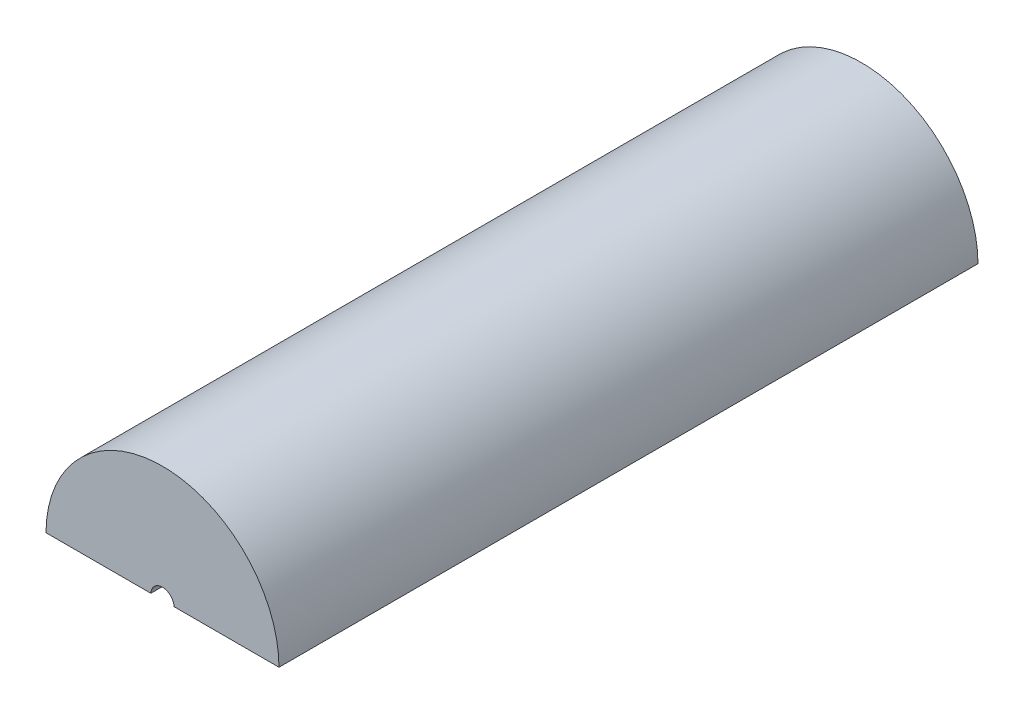
ISO-10303-21;
HEADER;
FILE_DESCRIPTION(('STEP AP214'),'2;1');
FILE_NAME('part.step','',(''),(''),'','','');
FILE_SCHEMA(('AUTOMOTIVE_DESIGN { 1 0 10303 214 1 1 1 1 }'));
ENDSEC;
DATA;
#1=APPLICATION_CONTEXT('core data for automotive mechanical design processes');
#2=APPLICATION_PROTOCOL_DEFINITION('international standard','automotive_design',2000,#1);
#3=PRODUCT_CONTEXT('',#1,'mechanical');
#4=PRODUCT('Part','Part','',(#3));
#5=PRODUCT_RELATED_PRODUCT_CATEGORY('part','',(#4));
#6=PRODUCT_DEFINITION_FORMATION('','',#4);
#7=PRODUCT_DEFINITION_CONTEXT('part definition',#1,'design');
#8=PRODUCT_DEFINITION('design','',#6,#7);
#9=PRODUCT_DEFINITION_SHAPE('','',#8);
#10=(LENGTH_UNIT() NAMED_UNIT(*) SI_UNIT(.MILLI.,.METRE.));
#11=(NAMED_UNIT(*) PLANE_ANGLE_UNIT() SI_UNIT($,.RADIAN.));
#12=(NAMED_UNIT(*) SI_UNIT($,.STERADIAN.) SOLID_ANGLE_UNIT());
#13=UNCERTAINTY_MEASURE_WITH_UNIT(LENGTH_MEASURE(1.E-05),#10,'distance_accuracy_value','');
#14=(GEOMETRIC_REPRESENTATION_CONTEXT(3) GLOBAL_UNCERTAINTY_ASSIGNED_CONTEXT((#13)) GLOBAL_UNIT_ASSIGNED_CONTEXT((#10,
#11,#12)) REPRESENTATION_CONTEXT('',''));
#15=CARTESIAN_POINT('',(0.,0.,0.));
#16=DIRECTION('',(0.,0.,1.));
#17=DIRECTION('',(1.,0.,0.));
#18=AXIS2_PLACEMENT_3D('',#15,#16,#17);
#19=CARTESIAN_POINT('',(0.,0.,-95.));
#20=DIRECTION('',(0.,0.,1.));
#21=DIRECTION('',(1.,0.,0.));
#22=AXIS2_PLACEMENT_3D('',#19,#20,#21);
#23=CYLINDRICAL_SURFACE('',#22,16.);
#24=CARTESIAN_POINT('',(15.9996874956982,0.100000200000962,-95.0002));
#25=CARTESIAN_POINT('',(15.9996876089245,0.0999613166636497,-94.9933909110656));
#26=CARTESIAN_POINT('',(15.9996833359999,0.100667343260459,-94.9866189886162));
#27=CARTESIAN_POINT('',(15.9996664742526,0.103322093203284,-94.9734331409172));
#28=CARTESIAN_POINT('',(15.9996540231289,0.105250221129936,-94.9670151631769));
#29=CARTESIAN_POINT('',(15.9996167256408,0.110786102343066,-94.9528734828148));
#30=CARTESIAN_POINT('',(15.9995894090706,0.11471028723087,-94.9452773244607));
#31=CARTESIAN_POINT('',(15.9995223957738,0.12370890358297,-94.9307562380063));
#32=CARTESIAN_POINT('',(15.999482612251,0.128791329006479,-94.9238364763829));
#33=CARTESIAN_POINT('',(15.9993504725112,0.144525673591268,-94.904808843254));
#34=CARTESIAN_POINT('',(15.9992426946636,0.1561363522168,-94.8935076802659));
#35=CARTESIAN_POINT('',(15.998984408498,0.180705288968248,-94.8725336488729));
#36=CARTESIAN_POINT('',(15.9988338081395,0.193666411233282,-94.8628643600561));
#37=CARTESIAN_POINT('',(15.9980346259693,0.255298625632148,-94.8205617079184));
#38=CARTESIAN_POINT('',(15.9971179787717,0.308242970572141,-94.7944084734029));
#39=CARTESIAN_POINT('',(15.9946762218346,0.416398657564381,-94.747491478125));
#40=CARTESIAN_POINT('',(15.9931468802502,0.471623319166156,-94.7267668945409));
#41=CARTESIAN_POINT('',(15.9876683633117,0.637564752046911,-94.6698337453855));
#42=CARTESIAN_POINT('',(15.982813728992,0.749883874807342,-94.6382317593188));
#43=CARTESIAN_POINT('',(15.9706204430243,0.975817455917367,-94.5805638647358));
#44=CARTESIAN_POINT('',(15.9632772031576,1.08943392957803,-94.5545083276732));
#45=CARTESIAN_POINT('',(15.946108566696,1.31703651192761,-94.5060300565223));
#46=CARTESIAN_POINT('',(15.9362882944059,1.43102138372045,-94.4835999776359));
#47=CARTESIAN_POINT('',(15.9141618109084,1.65909642172321,-94.441203693864));
#48=CARTESIAN_POINT('',(15.9018574595061,1.77318644596788,-94.421235663577));
#49=CARTESIAN_POINT('',(15.8386705583791,2.30505946467228,-94.3321411780839));
#50=CARTESIAN_POINT('',(15.7722764358871,2.72289413244487,-94.2736362565787));
#51=CARTESIAN_POINT('',(15.6061590460522,3.55355292641803,-94.1673325131355));
#52=CARTESIAN_POINT('',(15.5063990006465,3.9663710003421,-94.1195456028093));
#53=CARTESIAN_POINT('',(15.2738971238386,4.78425016336286,-94.0310629905377));
#54=CARTESIAN_POINT('',(15.1410951067343,5.18929562832988,-93.9903804618779));
#55=CARTESIAN_POINT('',(14.8434558371158,5.98776591234989,-93.9141900760265));
#56=CARTESIAN_POINT('',(14.6786295456577,6.3811946545708,-93.8786804555422));
#57=CARTESIAN_POINT('',(14.3183042194909,7.15312590557042,-93.8118329726691));
#58=CARTESIAN_POINT('',(14.122868793987,7.53165737562533,-93.7804867026022));
#59=CARTESIAN_POINT('',(13.7022902081215,8.27215629418123,-93.721208755686));
#60=CARTESIAN_POINT('',(13.4771448061774,8.63412249007385,-93.6932773367896));
#61=CARTESIAN_POINT('',(12.9987065689512,9.3388932284815,-93.6404131747481));
#62=CARTESIAN_POINT('',(12.7454290565378,9.68170805082223,-93.6154788144401));
#63=CARTESIAN_POINT('',(12.2122318728589,10.3461515685606,-93.568292528328));
#64=CARTESIAN_POINT('',(11.9323117119552,10.667779874409,-93.5460406518395));
#65=CARTESIAN_POINT('',(11.3317763928884,11.3045375699943,-93.5028700138265));
#66=CARTESIAN_POINT('',(11.0097789725468,11.6183742775231,-93.4820884778206));
#67=CARTESIAN_POINT('',(10.3404223446201,12.2179195559933,-93.443091603038));
#68=CARTESIAN_POINT('',(9.99306204875921,12.503626918718,-93.4248763744754));
#69=CARTESIAN_POINT('',(9.27536172801475,13.0449120839114,-93.3908787227275));
#70=CARTESIAN_POINT('',(8.90501607913624,13.300482467832,-93.3750968982585));
#71=CARTESIAN_POINT('',(8.14405853740691,13.7795665483632,-93.3458758669486));
#72=CARTESIAN_POINT('',(7.75344686456849,14.0030805928853,-93.3324366346828));
#73=CARTESIAN_POINT('',(6.95497153645159,14.4163217268977,-93.3078370478819));
#74=CARTESIAN_POINT('',(6.5471183822281,14.6060690255832,-93.2966753296779));
#75=CARTESIAN_POINT('',(5.71684009610057,14.9505769688768,-93.2765684201727));
#76=CARTESIAN_POINT('',(5.29441493339596,15.1053375395289,-93.267623233557));
#77=CARTESIAN_POINT('',(4.43801939847277,15.3787521135395,-93.2519118745392));
#78=CARTESIAN_POINT('',(4.00404957262244,15.4974078223197,-93.2451455992148));
#79=CARTESIAN_POINT('',(3.12763494114479,15.6977693048596,-93.2337649598654));
#80=CARTESIAN_POINT('',(2.68519014406141,15.7794751158678,-93.2291505936709));
#81=CARTESIAN_POINT('',(1.79528754715403,15.9053054539425,-93.2220591578145));
#82=CARTESIAN_POINT('',(1.34783347135442,15.949456235396,-93.2195805950155));
#83=CARTESIAN_POINT('',(0.450790584374749,15.9999561458381,-93.2167464468439));
#84=CARTESIAN_POINT('',(0.00120177397525275,16.0063052886476,-93.2163908606951));
#85=CARTESIAN_POINT('',(-0.896915468850043,15.9811562701698,-93.2178014243669));
#86=CARTESIAN_POINT('',(-1.34544389467319,15.9496578738371,-93.2195675873641));
#87=CARTESIAN_POINT('',(-2.23824728385251,15.8490395450346,-93.2252279223656));
#88=CARTESIAN_POINT('',(-2.68252224753776,15.7799196154753,-93.2291220942052));
#89=CARTESIAN_POINT('',(-3.56356082605615,15.6045741075047,-93.2390515384342));
#90=CARTESIAN_POINT('',(-4.0003260947656,15.4983568118579,-93.2450863328894));
#91=CARTESIAN_POINT('',(-4.86334332701998,15.2495758728171,-93.2593202877308));
#92=CARTESIAN_POINT('',(-5.28959529058503,15.1070122294925,-93.2675194481129));
#93=CARTESIAN_POINT('',(-6.12853978672644,14.7865688767694,-93.2861154409353));
#94=CARTESIAN_POINT('',(-6.54123291639549,14.608690724958,-93.2965121764503));
#95=CARTESIAN_POINT('',(-7.35014986045461,14.2188912851071,-93.3195503530631));
#96=CARTESIAN_POINT('',(-7.74637369200348,14.006970032537,-93.3321917918222));
#97=CARTESIAN_POINT('',(-8.51961263704004,13.5505641232963,-93.3597855869767));
#98=CARTESIAN_POINT('',(-8.89662425848611,13.3060735757599,-93.3747383615063));
#99=CARTESIAN_POINT('',(-9.62869175778507,12.7863135610525,-93.4070393256557));
#100=CARTESIAN_POINT('',(-9.98374751583813,12.5110439259616,-93.4243875283442));
#101=CARTESIAN_POINT('',(-10.6694792407113,11.9316282797633,-93.4616007689872));
#102=CARTESIAN_POINT('',(-11.0001487105794,11.6274746224466,-93.4814664738458));
#103=CARTESIAN_POINT('',(-11.6346591976653,10.9925490503296,-93.5238700275449));
#104=CARTESIAN_POINT('',(-11.9385007879715,10.6617777044161,-93.5464078192812));
#105=CARTESIAN_POINT('',(-12.5175748096972,9.97557596942283,-93.5944067247153));
#106=CARTESIAN_POINT('',(-12.7927717936654,9.62011591383932,-93.6198713803148));
#107=CARTESIAN_POINT('',(-13.3121916675464,8.88747395326126,-93.6740177660672));
#108=CARTESIAN_POINT('',(-13.5564145341072,8.5102920318905,-93.7026994986455));
#109=CARTESIAN_POINT('',(-14.0119527470274,7.73732704436563,-93.7637165519852));
#110=CARTESIAN_POINT('',(-14.2232996532385,7.34156229834177,-93.7960483167205));
#111=CARTESIAN_POINT('',(-14.6118286863923,6.53414934695187,-93.8650877076882));
#112=CARTESIAN_POINT('',(-14.7890230018084,6.12250687125296,-93.9017937652141));
#113=CARTESIAN_POINT('',(-15.1177607492653,5.26103448784112,-93.983159496293));
#114=CARTESIAN_POINT('',(-15.2671113616025,4.81039908055287,-94.0281654395767));
#115=CARTESIAN_POINT('',(-15.5248572014904,3.89905972148052,-94.1269000413085));
#116=CARTESIAN_POINT('',(-15.6333036882283,3.43836914181639,-94.1806176610893));
#117=CARTESIAN_POINT('',(-15.7813900769093,2.65577909383101,-94.2838014491195));
#118=CARTESIAN_POINT('',(-15.8319409012199,2.33540706536194,-94.329367974295));
#119=CARTESIAN_POINT('',(-15.9002382703701,1.79734487173969,-94.4162924843739));
#120=CARTESIAN_POINT('',(-15.9233064477128,1.57979492636594,-94.4542844166125));
#121=CARTESIAN_POINT('',(-15.9544067904815,1.21598143195715,-94.526649954306));
#122=CARTESIAN_POINT('',(-15.9648889140043,1.06939233534718,-94.5582276551417));
#123=CARTESIAN_POINT('',(-15.9790250330549,0.824957421528892,-94.618442989865));
#124=CARTESIAN_POINT('',(-15.9837908511062,0.726611608048616,-94.6447545962855));
#125=CARTESIAN_POINT('',(-15.9902319927996,0.562904755644311,-94.6950284405078));
#126=CARTESIAN_POINT('',(-15.9924081891383,0.497017516865857,-94.7170683716298));
#127=CARTESIAN_POINT('',(-15.9953597411122,0.387904962510545,-94.7594426264724));
#128=CARTESIAN_POINT('',(-15.9963603475854,0.344035447245782,-94.7781554322882));
#129=CARTESIAN_POINT('',(-15.9979512664039,0.259312220858589,-94.8201764183357));
#130=CARTESIAN_POINT('',(-15.9985504319209,0.218412502791065,-94.8433698180542));
#131=CARTESIAN_POINT('',(-15.9990578807033,0.173824630302468,-94.8783505669943));
#132=CARTESIAN_POINT('',(-15.9991394252677,0.166113741329733,-94.8848132898163));
#133=CARTESIAN_POINT('',(-15.9992862499205,0.151304439600525,-94.8984673443612));
#134=CARTESIAN_POINT('',(-15.9993514722893,0.144208256854711,-94.9056611387241));
#135=CARTESIAN_POINT('',(-15.9994661937343,0.130869905594723,-94.9210435021399));
#136=CARTESIAN_POINT('',(-15.9995153992775,0.124644757665149,-94.9292472105922));
#137=CARTESIAN_POINT('',(-15.999595721391,0.113866231631533,-94.946638258446));
#138=CARTESIAN_POINT('',(-15.9996270134528,0.109296801565154,-94.9558149732172));
#139=CARTESIAN_POINT('',(-15.9996617272515,0.104060878598926,-94.9709724047725));
#140=CARTESIAN_POINT('',(-15.9996713395364,0.102561035050069,-94.9766615397993));
#141=CARTESIAN_POINT('',(-15.9996843150547,0.10050957319414,-94.9882916988312));
#142=CARTESIAN_POINT('',(-15.9996875841723,0.0999722449097768,-94.9942351985383));
#143=CARTESIAN_POINT('',(-15.9996874956982,0.100000200000466,-95.0001999999998));
#144=B_SPLINE_CURVE_WITH_KNOTS('',3,(#24,#25,#26,#27,#28,#29,#30,#31,#32,#33,#34,#35,#36,#37,
#38,#39,#40,#41,#42,#43,#44,#45,#46,#47,#48,#49,#50,#51,#52,#53,#54,#55,#56,#57,#58,#59,#60,#61,
#62,#63,#64,#65,#66,#67,#68,#69,#70,#71,#72,#73,#74,#75,#76,#77,#78,#79,#80,#81,#82,#83,#84,#85,
#86,#87,#88,#89,#90,#91,#92,#93,#94,#95,#96,#97,#98,#99,#100,#101,#102,#103,#104,#105,#106,#107,
#108,#109,#110,#111,#112,#113,#114,#115,#116,#117,#118,#119,#120,#121,#122,#123,#124,#125,#126,
#127,#128,#129,#130,#131,#132,#133,#134,#135,#136,#137,#138,#139,#140,#141,#142,#143),
.UNSPECIFIED.,.F.,.F.,(4,2,2,2,2,2,2,2,2,2,2,2,2,2,2,2,2,2,2,2,2,2,2,2,2,2,2,2,2,2,2,2,2,2,2,2,
2,2,2,2,2,2,2,2,2,2,2,2,2,2,2,2,2,2,2,2,2,2,2,4),(0.,0.0203276874997605,0.0403215946535451,
0.065825125902997,0.0915103154199048,0.139848278536348,0.188290932517293,0.36412759133813,
0.541200279900517,0.890934143550809,1.24131634820838,1.59097956872924,1.94038196434234,
3.21978914217602,4.50061123809633,5.78378364410675,7.06651762563987,8.34662047222082,
9.62681995632306,10.906325535322,12.1858546335926,13.5345983833171,14.8834000392726,
16.2325330275021,17.581651372312,18.9299595422557,20.2782705622669,21.6265178845921,
22.9747638477702,24.322066487723,25.6693686350781,27.0166791496503,28.3639895599907,
29.7109993471412,31.0580091317129,32.4049595180578,33.7519085010272,35.0991014406618,
36.4463017304629,37.7938596520177,39.1413887805218,40.4905661201075,41.8397444768574,
43.1876195653679,44.5350127260693,45.9637046065986,47.390600119742,48.3724501280647,
49.0382740287623,49.4890061413488,49.7946381014166,50.0028950691584,50.1460340758411,
50.285902203099,50.3160520631035,50.3463070804724,50.3770888730386,50.4075637074367,
50.425137628634,50.4429703648064),.UNSPECIFIED.);
#145=CARTESIAN_POINT('',(15.9996874969482,0.1,-95.));
#146=VERTEX_POINT('',#145);
#147=CARTESIAN_POINT('',(-15.9996874969482,0.1,-95.));
#148=VERTEX_POINT('',#147);
#149=EDGE_CURVE('E96',#146,#148,#144,.T.);
#150=ORIENTED_EDGE('',*,*,#149,.F.);
#151=DIRECTION('',(0.,0.,1.));
#152=VECTOR('',#151,1.);
#153=CARTESIAN_POINT('',(15.9996874969482,0.1,-95.));
#154=LINE('',#153,#152);
#155=CARTESIAN_POINT('',(15.9996874969482,0.1,-5.));
#156=VERTEX_POINT('',#155);
#157=EDGE_CURVE('E108',#146,#156,#154,.T.);
#158=ORIENTED_EDGE('',*,*,#157,.T.);
#159=CARTESIAN_POINT('',(0.,0.,-5.));
#160=DIRECTION('',(0.,0.,1.));
#161=DIRECTION('',(1.,0.,0.));
#162=AXIS2_PLACEMENT_3D('',#159,#160,#161);
#163=CIRCLE('',#162,16.);
#164=CARTESIAN_POINT('',(-15.9996874969482,0.1,-5.));
#165=VERTEX_POINT('',#164);
#166=EDGE_CURVE('E100',#156,#165,#163,.T.);
#167=ORIENTED_EDGE('',*,*,#166,.T.);
#168=DIRECTION('',(0.,0.,1.));
#169=VECTOR('',#168,1.);
#170=CARTESIAN_POINT('',(-15.9996874969482,0.1,-95.));
#171=LINE('',#170,#169);
#172=EDGE_CURVE('E106',#165,#148,#171,.F.);
#173=ORIENTED_EDGE('',*,*,#172,.T.);
#174=EDGE_LOOP('',(#150,#158,#167,#173));
#175=FACE_BOUND('',#174,.T.);
#176=ADVANCED_FACE('F39',(#175),#23,.F.);
#177=CARTESIAN_POINT('',(0.,0.,-5.));
#178=DIRECTION('',(0.,0.,1.));
#179=DIRECTION('',(1.,0.,0.));
#180=AXIS2_PLACEMENT_3D('',#177,#178,#179);
#181=PLANE('',#180);
#182=DIRECTION('',(-1.,0.,0.));
#183=VECTOR('',#182,1.);
#184=CARTESIAN_POINT('',(0.,0.1,-5.));
#185=LINE('',#184,#183);
#186=CARTESIAN_POINT('',(1.99749843554382,0.1,-5.));
#187=VERTEX_POINT('',#186);
#188=EDGE_CURVE('E62',#156,#187,#185,.T.);
#189=ORIENTED_EDGE('',*,*,#188,.T.);
#190=CARTESIAN_POINT('',(0.,0.,-5.));
#191=DIRECTION('',(0.,0.,1.));
#192=DIRECTION('',(1.,0.,0.));
#193=AXIS2_PLACEMENT_3D('',#190,#191,#192);
#194=CIRCLE('',#193,2.);
#195=CARTESIAN_POINT('',(-1.99749843554382,0.1,-5.));
#196=VERTEX_POINT('',#195);
#197=EDGE_CURVE('E135',#187,#196,#194,.T.);
#198=ORIENTED_EDGE('',*,*,#197,.T.);
#199=EDGE_CURVE('E111',#196,#165,#185,.T.);
#200=ORIENTED_EDGE('',*,*,#199,.T.);
#201=ORIENTED_EDGE('',*,*,#166,.F.);
#202=EDGE_LOOP('',(#189,#198,#200,#201));
#203=FACE_BOUND('',#202,.T.);
#204=ADVANCED_FACE('F140',(#203),#181,.F.);
#205=CARTESIAN_POINT('',(-22.2825260642044,0.1,20.));
#206=DIRECTION('',(0.,1.,0.));
#207=DIRECTION('',(0.,0.,1.));
#208=AXIS2_PLACEMENT_3D('',#205,#206,#207);
#209=PLANE('',#208);
#210=ORIENTED_EDGE('',*,*,#199,.F.);
#211=DIRECTION('',(0.,0.,1.));
#212=VECTOR('',#211,1.);
#213=CARTESIAN_POINT('',(-1.99749843554382,0.1,-10.));
#214=LINE('',#213,#212);
#215=CARTESIAN_POINT('',(-1.99749843554382,0.1,0.));
#216=VERTEX_POINT('',#215);
#217=EDGE_CURVE('E101',#196,#216,#214,.T.);
#218=ORIENTED_EDGE('',*,*,#217,.T.);
#219=DIRECTION('',(-1.,0.,0.));
#220=VECTOR('',#219,1.);
#221=CARTESIAN_POINT('',(0.,0.1,0.));
#222=LINE('',#221,#220);
#223=CARTESIAN_POINT('',(-19.9997499984375,0.1,0.));
#224=VERTEX_POINT('',#223);
#225=EDGE_CURVE('E95',#216,#224,#222,.T.);
#226=ORIENTED_EDGE('',*,*,#225,.T.);
#227=DIRECTION('',(0.,0.,1.));
#228=VECTOR('',#227,1.);
#229=CARTESIAN_POINT('',(-19.9997499984375,0.1,-120.));
#230=LINE('',#229,#228);
#231=CARTESIAN_POINT('',(-19.9997499984375,0.1,-120.));
#232=VERTEX_POINT('',#231);
#233=EDGE_CURVE('E78',#224,#232,#230,.F.);
#234=ORIENTED_EDGE('',*,*,#233,.T.);
#235=DIRECTION('',(1.,0.,0.));
#236=VECTOR('',#235,1.);
#237=CARTESIAN_POINT('',(-22.2825260642044,0.1,-120.));
#238=LINE('',#237,#236);
#239=CARTESIAN_POINT('',(19.9997499984375,0.1,-120.));
#240=VERTEX_POINT('',#239);
#241=EDGE_CURVE('E117',#232,#240,#238,.T.);
#242=ORIENTED_EDGE('',*,*,#241,.T.);
#243=DIRECTION('',(0.,0.,1.));
#244=VECTOR('',#243,1.);
#245=CARTESIAN_POINT('',(19.9997499984375,0.1,-120.));
#246=LINE('',#245,#244);
#247=CARTESIAN_POINT('',(19.9997499984375,0.1,0.));
#248=VERTEX_POINT('',#247);
#249=EDGE_CURVE('E119',#240,#248,#246,.T.);
#250=ORIENTED_EDGE('',*,*,#249,.T.);
#251=CARTESIAN_POINT('',(1.99749843554382,0.1,0.));
#252=VERTEX_POINT('',#251);
#253=EDGE_CURVE('E114',#248,#252,#222,.T.);
#254=ORIENTED_EDGE('',*,*,#253,.T.);
#255=DIRECTION('',(0.,0.,1.));
#256=VECTOR('',#255,1.);
#257=CARTESIAN_POINT('',(1.99749843554382,0.1,-10.));
#258=LINE('',#257,#256);
#259=EDGE_CURVE('E54',#252,#187,#258,.F.);
#260=ORIENTED_EDGE('',*,*,#259,.T.);
#261=ORIENTED_EDGE('',*,*,#188,.F.);
#262=ORIENTED_EDGE('',*,*,#157,.F.);
#263=CARTESIAN_POINT('',(0.,0.1,-95.));
#264=DIRECTION('',(0.,1.,0.));
#265=DIRECTION('',(0.,0.,1.));
#266=AXIS2_PLACEMENT_3D('',#263,#264,#265);
#267=CIRCLE('',#266,15.9996874969482);
#268=EDGE_CURVE('E11',#148,#146,#267,.F.);
#269=ORIENTED_EDGE('',*,*,#268,.F.);
#270=ORIENTED_EDGE('',*,*,#172,.F.);
#271=EDGE_LOOP('',(#210,#218,#226,#234,#242,#250,#254,#260,#261,#262,#269,#270));
#272=FACE_BOUND('',#271,.T.);
#273=ADVANCED_FACE('F105',(#272),#209,.F.);
#274=CARTESIAN_POINT('',(0.,0.,-120.));
#275=DIRECTION('',(0.,0.,1.));
#276=DIRECTION('',(1.,0.,0.));
#277=AXIS2_PLACEMENT_3D('',#274,#275,#276);
#278=CYLINDRICAL_SURFACE('',#277,20.);
#279=ORIENTED_EDGE('',*,*,#233,.F.);
#280=CARTESIAN_POINT('',(0.,0.,0.));
#281=DIRECTION('',(0.,0.,1.));
#282=DIRECTION('',(1.,0.,0.));
#283=AXIS2_PLACEMENT_3D('',#280,#281,#282);
#284=CIRCLE('',#283,20.);
#285=EDGE_CURVE('E47',#248,#224,#284,.T.);
#286=ORIENTED_EDGE('',*,*,#285,.F.);
#287=ORIENTED_EDGE('',*,*,#249,.F.);
#288=CARTESIAN_POINT('',(0.,0.,-120.));
#289=DIRECTION('',(0.,0.,1.));
#290=DIRECTION('',(1.,0.,0.));
#291=AXIS2_PLACEMENT_3D('',#288,#289,#290);
#292=CIRCLE('',#291,20.);
#293=EDGE_CURVE('E120',#240,#232,#292,.T.);
#294=ORIENTED_EDGE('',*,*,#293,.T.);
#295=EDGE_LOOP('',(#279,#286,#287,#294));
#296=FACE_BOUND('',#295,.T.);
#297=ADVANCED_FACE('F41',(#296),#278,.T.);
#298=CARTESIAN_POINT('',(0.,0.,-120.));
#299=DIRECTION('',(0.,0.,1.));
#300=DIRECTION('',(1.,0.,0.));
#301=AXIS2_PLACEMENT_3D('',#298,#299,#300);
#302=PLANE('',#301);
#303=ORIENTED_EDGE('',*,*,#293,.F.);
#304=ORIENTED_EDGE('',*,*,#241,.F.);
#305=EDGE_LOOP('',(#303,#304));
#306=FACE_BOUND('',#305,.T.);
#307=ADVANCED_FACE('F173',(#306),#302,.F.);
#308=CARTESIAN_POINT('',(0.,0.,0.));
#309=DIRECTION('',(0.,0.,1.));
#310=DIRECTION('',(1.,0.,0.));
#311=AXIS2_PLACEMENT_3D('',#308,#309,#310);
#312=PLANE('',#311);
#313=CARTESIAN_POINT('',(0.,0.,0.));
#314=DIRECTION('',(0.,0.,1.));
#315=DIRECTION('',(1.,0.,0.));
#316=AXIS2_PLACEMENT_3D('',#313,#314,#315);
#317=CIRCLE('',#316,2.);
#318=EDGE_CURVE('E136',#252,#216,#317,.T.);
#319=ORIENTED_EDGE('',*,*,#318,.F.);
#320=ORIENTED_EDGE('',*,*,#253,.F.);
#321=ORIENTED_EDGE('',*,*,#285,.T.);
#322=ORIENTED_EDGE('',*,*,#225,.F.);
#323=EDGE_LOOP('',(#319,#320,#321,#322));
#324=FACE_BOUND('',#323,.T.);
#325=ADVANCED_FACE('F127',(#324),#312,.T.);
#326=CARTESIAN_POINT('',(0.,0.1,-95.));
#327=DIRECTION('',(-1.,0.,0.));
#328=DIRECTION('',(0.,0.,1.));
#329=AXIS2_PLACEMENT_3D('',#326,#327,#328);
#330=SPHERICAL_SURFACE('',#329,15.9996874969482);
#331=ORIENTED_EDGE('',*,*,#149,.T.);
#332=ORIENTED_EDGE('',*,*,#268,.T.);
#333=EDGE_LOOP('',(#331,#332));
#334=FACE_BOUND('',#333,.T.);
#335=ADVANCED_FACE('F97',(#334),#330,.F.);
#336=CARTESIAN_POINT('',(0.,0.,-10.));
#337=DIRECTION('',(0.,0.,1.));
#338=DIRECTION('',(1.,0.,0.));
#339=AXIS2_PLACEMENT_3D('',#336,#337,#338);
#340=CYLINDRICAL_SURFACE('',#339,2.);
#341=ORIENTED_EDGE('',*,*,#197,.F.);
#342=ORIENTED_EDGE('',*,*,#259,.F.);
#343=ORIENTED_EDGE('',*,*,#318,.T.);
#344=ORIENTED_EDGE('',*,*,#217,.F.);
#345=EDGE_LOOP('',(#341,#342,#343,#344));
#346=FACE_BOUND('',#345,.T.);
#347=ADVANCED_FACE('F157',(#346),#340,.F.);
#348=CLOSED_SHELL('',(#176,#204,#273,#297,#307,#325,#335,#347));
#349=MANIFOLD_SOLID_BREP('B2',#348);
#350=ADVANCED_BREP_SHAPE_REPRESENTATION('',(#18,#349),#14);
#351=SHAPE_DEFINITION_REPRESENTATION(#9,#350);
ENDSEC;
END-ISO-10303-21;
